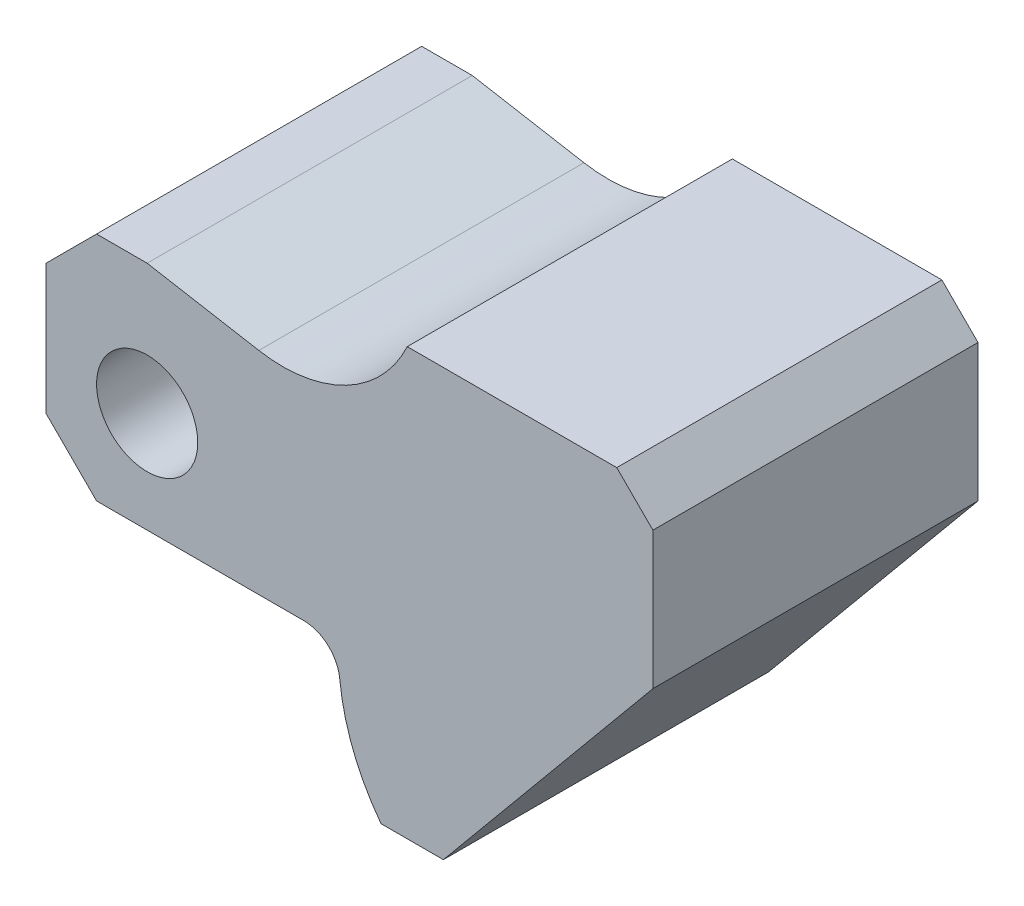
ISO-10303-21;
HEADER;
FILE_DESCRIPTION(('STEP AP214'),'2;1');
FILE_NAME('part.step','',(''),(''),'','','');
FILE_SCHEMA(('AUTOMOTIVE_DESIGN { 1 0 10303 214 1 1 1 1 }'));
ENDSEC;
DATA;
#1=APPLICATION_CONTEXT('core data for automotive mechanical design processes');
#2=APPLICATION_PROTOCOL_DEFINITION('international standard','automotive_design',2000,#1);
#3=PRODUCT_CONTEXT('',#1,'mechanical');
#4=PRODUCT('Part','Part','',(#3));
#5=PRODUCT_RELATED_PRODUCT_CATEGORY('part','',(#4));
#6=PRODUCT_DEFINITION_FORMATION('','',#4);
#7=PRODUCT_DEFINITION_CONTEXT('part definition',#1,'design');
#8=PRODUCT_DEFINITION('design','',#6,#7);
#9=PRODUCT_DEFINITION_SHAPE('','',#8);
#10=(LENGTH_UNIT() NAMED_UNIT(*) SI_UNIT(.MILLI.,.METRE.));
#11=(NAMED_UNIT(*) PLANE_ANGLE_UNIT() SI_UNIT($,.RADIAN.));
#12=(NAMED_UNIT(*) SI_UNIT($,.STERADIAN.) SOLID_ANGLE_UNIT());
#13=UNCERTAINTY_MEASURE_WITH_UNIT(LENGTH_MEASURE(1.E-05),#10,'distance_accuracy_value','');
#14=(GEOMETRIC_REPRESENTATION_CONTEXT(3) GLOBAL_UNCERTAINTY_ASSIGNED_CONTEXT((#13)) GLOBAL_UNIT_ASSIGNED_CONTEXT((#10,
#11,#12)) REPRESENTATION_CONTEXT('',''));
#15=CARTESIAN_POINT('',(0.,0.,0.));
#16=DIRECTION('',(0.,0.,1.));
#17=DIRECTION('',(1.,0.,0.));
#18=AXIS2_PLACEMENT_3D('',#15,#16,#17);
#19=CARTESIAN_POINT('',(18.7594959903131,33.9853003382447,45.));
#20=DIRECTION('',(0.,0.,1.));
#21=DIRECTION('',(1.,0.,0.));
#22=AXIS2_PLACEMENT_3D('',#19,#20,#21);
#23=PLANE('',#22);
#24=DIRECTION('',(-0.707106781186543,-0.707106781186552,0.));
#25=VECTOR('',#24,1.);
#26=CARTESIAN_POINT('',(-14.,11.,45.));
#27=LINE('',#26,#25);
#28=CARTESIAN_POINT('',(-7.00000000000008,18.,45.));
#29=VERTEX_POINT('',#28);
#30=CARTESIAN_POINT('',(-14.,11.,45.));
#31=VERTEX_POINT('',#30);
#32=EDGE_CURVE('E204',#29,#31,#27,.T.);
#33=ORIENTED_EDGE('',*,*,#32,.T.);
#34=DIRECTION('',(0.,-1.,0.));
#35=VECTOR('',#34,1.);
#36=CARTESIAN_POINT('',(-14.,11.,45.));
#37=LINE('',#36,#35);
#38=CARTESIAN_POINT('',(-14.,-7.,45.));
#39=VERTEX_POINT('',#38);
#40=EDGE_CURVE('E122',#31,#39,#37,.T.);
#41=ORIENTED_EDGE('',*,*,#40,.T.);
#42=DIRECTION('',(0.707106781186549,-0.707106781186546,0.));
#43=VECTOR('',#42,1.);
#44=CARTESIAN_POINT('',(-14.,-7.,45.));
#45=LINE('',#44,#43);
#46=CARTESIAN_POINT('',(-6.99999999999997,-14.,45.));
#47=VERTEX_POINT('',#46);
#48=EDGE_CURVE('E237',#39,#47,#45,.T.);
#49=ORIENTED_EDGE('',*,*,#48,.T.);
#50=DIRECTION('',(1.,0.,0.));
#51=VECTOR('',#50,1.);
#52=CARTESIAN_POINT('',(-6.99999999999997,-14.,45.));
#53=LINE('',#52,#51);
#54=CARTESIAN_POINT('',(21.6806268538283,-14.,45.));
#55=VERTEX_POINT('',#54);
#56=EDGE_CURVE('E256',#47,#55,#53,.T.);
#57=ORIENTED_EDGE('',*,*,#56,.T.);
#58=CARTESIAN_POINT('',(21.6806268538283,-19.,45.));
#59=DIRECTION('',(0.,0.,-1.));
#60=DIRECTION('',(-1.,0.,0.));
#61=AXIS2_PLACEMENT_3D('',#58,#59,#60);
#62=CIRCLE('',#61,5.);
#63=CARTESIAN_POINT('',(26.6540640812065,-18.4852941176471,45.));
#64=VERTEX_POINT('',#63);
#65=EDGE_CURVE('E253',#55,#64,#62,.T.);
#66=ORIENTED_EDGE('',*,*,#65,.T.);
#67=CARTESIAN_POINT('',(55.5,-15.5,45.));
#68=DIRECTION('',(0.,0.,1.));
#69=DIRECTION('',(1.,0.,0.));
#70=AXIS2_PLACEMENT_3D('',#67,#68,#69);
#71=CIRCLE('',#70,29.);
#72=CARTESIAN_POINT('',(32.3753378403056,-33.,45.));
#73=VERTEX_POINT('',#72);
#74=EDGE_CURVE('E255',#64,#73,#71,.T.);
#75=ORIENTED_EDGE('',*,*,#74,.T.);
#76=DIRECTION('',(1.,0.,0.));
#77=VECTOR('',#76,1.);
#78=CARTESIAN_POINT('',(41.,-33.,45.));
#79=LINE('',#78,#77);
#80=CARTESIAN_POINT('',(41.,-33.,45.));
#81=VERTEX_POINT('',#80);
#82=EDGE_CURVE('E258',#73,#81,#79,.T.);
#83=ORIENTED_EDGE('',*,*,#82,.T.);
#84=DIRECTION('',(0.638017864750323,0.770021560905562,0.));
#85=VECTOR('',#84,1.);
#86=CARTESIAN_POINT('',(70.,1.99999999999998,45.));
#87=LINE('',#86,#85);
#88=CARTESIAN_POINT('',(70.,1.99999999999998,45.));
#89=VERTEX_POINT('',#88);
#90=EDGE_CURVE('E264',#81,#89,#87,.T.);
#91=ORIENTED_EDGE('',*,*,#90,.T.);
#92=DIRECTION('',(0.,1.,0.));
#93=VECTOR('',#92,1.);
#94=CARTESIAN_POINT('',(70.,21.,45.));
#95=LINE('',#94,#93);
#96=CARTESIAN_POINT('',(70.,21.,45.));
#97=VERTEX_POINT('',#96);
#98=EDGE_CURVE('E266',#89,#97,#95,.T.);
#99=ORIENTED_EDGE('',*,*,#98,.T.);
#100=DIRECTION('',(-0.707106781186552,0.707106781186542,0.));
#101=VECTOR('',#100,1.);
#102=CARTESIAN_POINT('',(64.9999999999999,26.,45.));
#103=LINE('',#102,#101);
#104=CARTESIAN_POINT('',(64.9999999999999,26.,45.));
#105=VERTEX_POINT('',#104);
#106=EDGE_CURVE('E268',#97,#105,#103,.T.);
#107=ORIENTED_EDGE('',*,*,#106,.T.);
#108=DIRECTION('',(-1.,0.,0.));
#109=VECTOR('',#108,1.);
#110=CARTESIAN_POINT('',(36.,26.,45.));
#111=LINE('',#110,#109);
#112=CARTESIAN_POINT('',(36.,26.,45.));
#113=VERTEX_POINT('',#112);
#114=EDGE_CURVE('E159',#105,#113,#111,.T.);
#115=ORIENTED_EDGE('',*,*,#114,.T.);
#116=CARTESIAN_POINT('',(18.7594959903131,33.9853003382447,45.));
#117=DIRECTION('',(0.,0.,-1.));
#118=DIRECTION('',(1.,0.,0.));
#119=AXIS2_PLACEMENT_3D('',#116,#117,#118);
#120=CIRCLE('',#119,19.);
#121=CARTESIAN_POINT('',(15.4601806146414,15.2739530310127,45.));
#122=VERTEX_POINT('',#121);
#123=EDGE_CURVE('E153',#113,#122,#120,.T.);
#124=ORIENTED_EDGE('',*,*,#123,.T.);
#125=DIRECTION('',(-0.984807753012208,0.173648177666931,0.));
#126=VECTOR('',#125,1.);
#127=CARTESIAN_POINT('',(0.,18.,45.));
#128=LINE('',#127,#126);
#129=CARTESIAN_POINT('',(0.,18.,45.));
#130=VERTEX_POINT('',#129);
#131=EDGE_CURVE('E157',#122,#130,#128,.T.);
#132=ORIENTED_EDGE('',*,*,#131,.T.);
#133=DIRECTION('',(-1.,0.,0.));
#134=VECTOR('',#133,1.);
#135=CARTESIAN_POINT('',(-7.00000000000008,18.,45.));
#136=LINE('',#135,#134);
#137=EDGE_CURVE('E61',#130,#29,#136,.T.);
#138=ORIENTED_EDGE('',*,*,#137,.T.);
#139=EDGE_LOOP('',(#33,#41,#49,#57,#66,#75,#83,#91,#99,#107,#115,#124,#132,#138));
#140=FACE_BOUND('',#139,.T.);
#141=CARTESIAN_POINT('',(0.,0.,45.));
#142=DIRECTION('',(0.,0.,1.));
#143=DIRECTION('',(1.,0.,0.));
#144=AXIS2_PLACEMENT_3D('',#141,#142,#143);
#145=CIRCLE('',#144,7.);
#146=CARTESIAN_POINT('',(7.,0.,45.));
#147=VERTEX_POINT('',#146);
#148=EDGE_CURVE('E181',#147,#147,#145,.T.);
#149=ORIENTED_EDGE('',*,*,#148,.F.);
#150=EDGE_LOOP('',(#149));
#151=FACE_BOUND('',#150,.T.);
#152=ADVANCED_FACE('F44',(#140,#151),#23,.T.);
#153=CARTESIAN_POINT('',(18.7594959903131,33.9853003382447,0.));
#154=DIRECTION('',(0.,0.,1.));
#155=DIRECTION('',(1.,0.,0.));
#156=AXIS2_PLACEMENT_3D('',#153,#154,#155);
#157=PLANE('',#156);
#158=DIRECTION('',(-0.707106781186543,-0.707106781186552,0.));
#159=VECTOR('',#158,1.);
#160=CARTESIAN_POINT('',(-14.,11.,0.));
#161=LINE('',#160,#159);
#162=CARTESIAN_POINT('',(-7.00000000000008,18.,0.));
#163=VERTEX_POINT('',#162);
#164=CARTESIAN_POINT('',(-14.,11.,0.));
#165=VERTEX_POINT('',#164);
#166=EDGE_CURVE('E177',#163,#165,#161,.T.);
#167=ORIENTED_EDGE('',*,*,#166,.F.);
#168=DIRECTION('',(-1.,0.,0.));
#169=VECTOR('',#168,1.);
#170=CARTESIAN_POINT('',(-7.00000000000008,18.,0.));
#171=LINE('',#170,#169);
#172=CARTESIAN_POINT('',(0.,18.,0.));
#173=VERTEX_POINT('',#172);
#174=EDGE_CURVE('E114',#173,#163,#171,.T.);
#175=ORIENTED_EDGE('',*,*,#174,.F.);
#176=DIRECTION('',(-0.984807753012208,0.173648177666931,0.));
#177=VECTOR('',#176,1.);
#178=CARTESIAN_POINT('',(0.,18.,0.));
#179=LINE('',#178,#177);
#180=CARTESIAN_POINT('',(15.4601806146414,15.2739530310127,0.));
#181=VERTEX_POINT('',#180);
#182=EDGE_CURVE('E108',#181,#173,#179,.T.);
#183=ORIENTED_EDGE('',*,*,#182,.F.);
#184=CARTESIAN_POINT('',(18.7594959903131,33.9853003382447,0.));
#185=DIRECTION('',(0.,0.,-1.));
#186=DIRECTION('',(1.,0.,0.));
#187=AXIS2_PLACEMENT_3D('',#184,#185,#186);
#188=CIRCLE('',#187,19.);
#189=CARTESIAN_POINT('',(36.,26.,0.));
#190=VERTEX_POINT('',#189);
#191=EDGE_CURVE('E167',#190,#181,#188,.T.);
#192=ORIENTED_EDGE('',*,*,#191,.F.);
#193=DIRECTION('',(-1.,0.,0.));
#194=VECTOR('',#193,1.);
#195=CARTESIAN_POINT('',(36.,26.,0.));
#196=LINE('',#195,#194);
#197=CARTESIAN_POINT('',(64.9999999999999,26.,0.));
#198=VERTEX_POINT('',#197);
#199=EDGE_CURVE('E199',#198,#190,#196,.T.);
#200=ORIENTED_EDGE('',*,*,#199,.F.);
#201=DIRECTION('',(-0.707106781186552,0.707106781186542,0.));
#202=VECTOR('',#201,1.);
#203=CARTESIAN_POINT('',(64.9999999999999,26.,0.));
#204=LINE('',#203,#202);
#205=CARTESIAN_POINT('',(70.,21.,0.));
#206=VERTEX_POINT('',#205);
#207=EDGE_CURVE('E197',#206,#198,#204,.T.);
#208=ORIENTED_EDGE('',*,*,#207,.F.);
#209=DIRECTION('',(0.,1.,0.));
#210=VECTOR('',#209,1.);
#211=CARTESIAN_POINT('',(70.,21.,0.));
#212=LINE('',#211,#210);
#213=CARTESIAN_POINT('',(70.,1.99999999999998,0.));
#214=VERTEX_POINT('',#213);
#215=EDGE_CURVE('E195',#214,#206,#212,.T.);
#216=ORIENTED_EDGE('',*,*,#215,.F.);
#217=DIRECTION('',(0.638017864750323,0.770021560905562,0.));
#218=VECTOR('',#217,1.);
#219=CARTESIAN_POINT('',(70.,1.99999999999998,0.));
#220=LINE('',#219,#218);
#221=CARTESIAN_POINT('',(41.,-33.,0.));
#222=VERTEX_POINT('',#221);
#223=EDGE_CURVE('E193',#222,#214,#220,.T.);
#224=ORIENTED_EDGE('',*,*,#223,.F.);
#225=DIRECTION('',(1.,0.,0.));
#226=VECTOR('',#225,1.);
#227=CARTESIAN_POINT('',(41.,-33.,0.));
#228=LINE('',#227,#226);
#229=CARTESIAN_POINT('',(32.3753378403056,-33.,0.));
#230=VERTEX_POINT('',#229);
#231=EDGE_CURVE('E191',#230,#222,#228,.T.);
#232=ORIENTED_EDGE('',*,*,#231,.F.);
#233=CARTESIAN_POINT('',(55.5,-15.5,0.));
#234=DIRECTION('',(0.,0.,1.));
#235=DIRECTION('',(1.,0.,0.));
#236=AXIS2_PLACEMENT_3D('',#233,#234,#235);
#237=CIRCLE('',#236,29.);
#238=CARTESIAN_POINT('',(26.6540640812065,-18.4852941176471,0.));
#239=VERTEX_POINT('',#238);
#240=EDGE_CURVE('E189',#239,#230,#237,.T.);
#241=ORIENTED_EDGE('',*,*,#240,.F.);
#242=CARTESIAN_POINT('',(21.6806268538283,-19.,0.));
#243=DIRECTION('',(0.,0.,-1.));
#244=DIRECTION('',(-1.,0.,0.));
#245=AXIS2_PLACEMENT_3D('',#242,#243,#244);
#246=CIRCLE('',#245,5.);
#247=CARTESIAN_POINT('',(21.6806268538283,-14.,0.));
#248=VERTEX_POINT('',#247);
#249=EDGE_CURVE('E187',#248,#239,#246,.T.);
#250=ORIENTED_EDGE('',*,*,#249,.F.);
#251=DIRECTION('',(1.,0.,0.));
#252=VECTOR('',#251,1.);
#253=CARTESIAN_POINT('',(-6.99999999999997,-14.,0.));
#254=LINE('',#253,#252);
#255=CARTESIAN_POINT('',(-6.99999999999997,-14.,0.));
#256=VERTEX_POINT('',#255);
#257=EDGE_CURVE('E185',#256,#248,#254,.T.);
#258=ORIENTED_EDGE('',*,*,#257,.F.);
#259=DIRECTION('',(0.707106781186549,-0.707106781186546,0.));
#260=VECTOR('',#259,1.);
#261=CARTESIAN_POINT('',(-14.,-7.,0.));
#262=LINE('',#261,#260);
#263=CARTESIAN_POINT('',(-14.,-7.,0.));
#264=VERTEX_POINT('',#263);
#265=EDGE_CURVE('E183',#264,#256,#262,.T.);
#266=ORIENTED_EDGE('',*,*,#265,.F.);
#267=DIRECTION('',(0.,-1.,0.));
#268=VECTOR('',#267,1.);
#269=CARTESIAN_POINT('',(-14.,11.,0.));
#270=LINE('',#269,#268);
#271=EDGE_CURVE('E180',#165,#264,#270,.T.);
#272=ORIENTED_EDGE('',*,*,#271,.F.);
#273=EDGE_LOOP('',(#167,#175,#183,#192,#200,#208,#216,#224,#232,#241,#250,#258,#266,#272));
#274=FACE_BOUND('',#273,.T.);
#275=CARTESIAN_POINT('',(0.,0.,0.));
#276=DIRECTION('',(0.,0.,1.));
#277=DIRECTION('',(1.,0.,0.));
#278=AXIS2_PLACEMENT_3D('',#275,#276,#277);
#279=CIRCLE('',#278,7.);
#280=CARTESIAN_POINT('',(7.,0.,0.));
#281=VERTEX_POINT('',#280);
#282=EDGE_CURVE('E509',#281,#281,#279,.T.);
#283=ORIENTED_EDGE('',*,*,#282,.T.);
#284=EDGE_LOOP('',(#283));
#285=FACE_BOUND('',#284,.T.);
#286=ADVANCED_FACE('F241',(#274,#285),#157,.F.);
#287=CARTESIAN_POINT('',(-14.,11.,45.));
#288=DIRECTION('',(0.707106781186551,-0.707106781186543,0.));
#289=DIRECTION('',(0.707106781186544,0.707106781186552,0.));
#290=AXIS2_PLACEMENT_3D('',#287,#288,#289);
#291=PLANE('',#290);
#292=ORIENTED_EDGE('',*,*,#166,.T.);
#293=DIRECTION('',(0.,0.,-1.));
#294=VECTOR('',#293,1.);
#295=CARTESIAN_POINT('',(-14.,11.,45.));
#296=LINE('',#295,#294);
#297=EDGE_CURVE('E11',#31,#165,#296,.T.);
#298=ORIENTED_EDGE('',*,*,#297,.F.);
#299=ORIENTED_EDGE('',*,*,#32,.F.);
#300=DIRECTION('',(0.,0.,-1.));
#301=VECTOR('',#300,1.);
#302=CARTESIAN_POINT('',(-7.00000000000008,18.,45.));
#303=LINE('',#302,#301);
#304=EDGE_CURVE('E173',#29,#163,#303,.T.);
#305=ORIENTED_EDGE('',*,*,#304,.T.);
#306=EDGE_LOOP('',(#292,#298,#299,#305));
#307=FACE_BOUND('',#306,.T.);
#308=ADVANCED_FACE('F46',(#307),#291,.F.);
#309=CARTESIAN_POINT('',(-14.,11.,45.));
#310=DIRECTION('',(1.,0.,0.));
#311=DIRECTION('',(0.,0.,-1.));
#312=AXIS2_PLACEMENT_3D('',#309,#310,#311);
#313=PLANE('',#312);
#314=ORIENTED_EDGE('',*,*,#271,.T.);
#315=DIRECTION('',(0.,0.,-1.));
#316=VECTOR('',#315,1.);
#317=CARTESIAN_POINT('',(-14.,-7.,45.));
#318=LINE('',#317,#316);
#319=EDGE_CURVE('E53',#39,#264,#318,.T.);
#320=ORIENTED_EDGE('',*,*,#319,.F.);
#321=ORIENTED_EDGE('',*,*,#40,.F.);
#322=ORIENTED_EDGE('',*,*,#297,.T.);
#323=EDGE_LOOP('',(#314,#320,#321,#322));
#324=FACE_BOUND('',#323,.T.);
#325=ADVANCED_FACE('F302',(#324),#313,.F.);
#326=CARTESIAN_POINT('',(-14.,-7.,45.));
#327=DIRECTION('',(0.707106781186546,0.707106781186549,0.));
#328=DIRECTION('',(-0.707106781186549,0.707106781186546,0.));
#329=AXIS2_PLACEMENT_3D('',#326,#327,#328);
#330=PLANE('',#329);
#331=ORIENTED_EDGE('',*,*,#265,.T.);
#332=DIRECTION('',(0.,0.,-1.));
#333=VECTOR('',#332,1.);
#334=CARTESIAN_POINT('',(-6.99999999999997,-14.,45.));
#335=LINE('',#334,#333);
#336=EDGE_CURVE('E229',#47,#256,#335,.T.);
#337=ORIENTED_EDGE('',*,*,#336,.F.);
#338=ORIENTED_EDGE('',*,*,#48,.F.);
#339=ORIENTED_EDGE('',*,*,#319,.T.);
#340=EDGE_LOOP('',(#331,#337,#338,#339));
#341=FACE_BOUND('',#340,.T.);
#342=ADVANCED_FACE('F235',(#341),#330,.F.);
#343=CARTESIAN_POINT('',(-6.99999999999997,-14.,45.));
#344=DIRECTION('',(0.,1.,0.));
#345=DIRECTION('',(-1.,0.,0.));
#346=AXIS2_PLACEMENT_3D('',#343,#344,#345);
#347=PLANE('',#346);
#348=ORIENTED_EDGE('',*,*,#257,.T.);
#349=DIRECTION('',(0.,0.,-1.));
#350=VECTOR('',#349,1.);
#351=CARTESIAN_POINT('',(21.6806268538283,-14.,45.));
#352=LINE('',#351,#350);
#353=EDGE_CURVE('E226',#55,#248,#352,.T.);
#354=ORIENTED_EDGE('',*,*,#353,.F.);
#355=ORIENTED_EDGE('',*,*,#56,.F.);
#356=ORIENTED_EDGE('',*,*,#336,.T.);
#357=EDGE_LOOP('',(#348,#354,#355,#356));
#358=FACE_BOUND('',#357,.T.);
#359=ADVANCED_FACE('F247',(#358),#347,.F.);
#360=CARTESIAN_POINT('',(21.6806268538283,-19.,45.));
#361=DIRECTION('',(0.,0.,-1.));
#362=DIRECTION('',(-1.,0.,0.));
#363=AXIS2_PLACEMENT_3D('',#360,#361,#362);
#364=CYLINDRICAL_SURFACE('',#363,5.);
#365=ORIENTED_EDGE('',*,*,#249,.T.);
#366=DIRECTION('',(0.,0.,-1.));
#367=VECTOR('',#366,1.);
#368=CARTESIAN_POINT('',(26.6540640812065,-18.4852941176471,45.));
#369=LINE('',#368,#367);
#370=EDGE_CURVE('E223',#64,#239,#369,.T.);
#371=ORIENTED_EDGE('',*,*,#370,.F.);
#372=ORIENTED_EDGE('',*,*,#65,.F.);
#373=ORIENTED_EDGE('',*,*,#353,.T.);
#374=EDGE_LOOP('',(#365,#371,#372,#373));
#375=FACE_BOUND('',#374,.T.);
#376=ADVANCED_FACE('F251',(#375),#364,.F.);
#377=CARTESIAN_POINT('',(55.5,-15.5,45.));
#378=DIRECTION('',(0.,0.,-1.));
#379=DIRECTION('',(-1.,0.,0.));
#380=AXIS2_PLACEMENT_3D('',#377,#378,#379);
#381=CYLINDRICAL_SURFACE('',#380,29.);
#382=ORIENTED_EDGE('',*,*,#240,.T.);
#383=DIRECTION('',(0.,0.,-1.));
#384=VECTOR('',#383,1.);
#385=CARTESIAN_POINT('',(32.3753378403056,-33.,45.));
#386=LINE('',#385,#384);
#387=EDGE_CURVE('E220',#73,#230,#386,.T.);
#388=ORIENTED_EDGE('',*,*,#387,.F.);
#389=ORIENTED_EDGE('',*,*,#74,.F.);
#390=ORIENTED_EDGE('',*,*,#370,.T.);
#391=EDGE_LOOP('',(#382,#388,#389,#390));
#392=FACE_BOUND('',#391,.T.);
#393=ADVANCED_FACE('F315',(#392),#381,.T.);
#394=CARTESIAN_POINT('',(41.,-33.,45.));
#395=DIRECTION('',(0.,1.,0.));
#396=DIRECTION('',(-1.,0.,0.));
#397=AXIS2_PLACEMENT_3D('',#394,#395,#396);
#398=PLANE('',#397);
#399=ORIENTED_EDGE('',*,*,#231,.T.);
#400=DIRECTION('',(0.,0.,-1.));
#401=VECTOR('',#400,1.);
#402=CARTESIAN_POINT('',(41.,-33.,45.));
#403=LINE('',#402,#401);
#404=EDGE_CURVE('E217',#81,#222,#403,.T.);
#405=ORIENTED_EDGE('',*,*,#404,.F.);
#406=ORIENTED_EDGE('',*,*,#82,.F.);
#407=ORIENTED_EDGE('',*,*,#387,.T.);
#408=EDGE_LOOP('',(#399,#405,#406,#407));
#409=FACE_BOUND('',#408,.T.);
#410=ADVANCED_FACE('F318',(#409),#398,.F.);
#411=CARTESIAN_POINT('',(70.,1.99999999999998,45.));
#412=DIRECTION('',(-0.770021560905562,0.638017864750323,0.));
#413=DIRECTION('',(-0.638017864750323,-0.770021560905562,0.));
#414=AXIS2_PLACEMENT_3D('',#411,#412,#413);
#415=PLANE('',#414);
#416=ORIENTED_EDGE('',*,*,#223,.T.);
#417=DIRECTION('',(0.,0.,-1.));
#418=VECTOR('',#417,1.);
#419=CARTESIAN_POINT('',(70.,1.99999999999998,45.));
#420=LINE('',#419,#418);
#421=EDGE_CURVE('E214',#89,#214,#420,.T.);
#422=ORIENTED_EDGE('',*,*,#421,.F.);
#423=ORIENTED_EDGE('',*,*,#90,.F.);
#424=ORIENTED_EDGE('',*,*,#404,.T.);
#425=EDGE_LOOP('',(#416,#422,#423,#424));
#426=FACE_BOUND('',#425,.T.);
#427=ADVANCED_FACE('F322',(#426),#415,.F.);
#428=CARTESIAN_POINT('',(70.,21.,45.));
#429=DIRECTION('',(-1.,0.,0.));
#430=DIRECTION('',(0.,0.,1.));
#431=AXIS2_PLACEMENT_3D('',#428,#429,#430);
#432=PLANE('',#431);
#433=ORIENTED_EDGE('',*,*,#215,.T.);
#434=DIRECTION('',(0.,0.,-1.));
#435=VECTOR('',#434,1.);
#436=CARTESIAN_POINT('',(70.,21.,45.));
#437=LINE('',#436,#435);
#438=EDGE_CURVE('E211',#97,#206,#437,.T.);
#439=ORIENTED_EDGE('',*,*,#438,.F.);
#440=ORIENTED_EDGE('',*,*,#98,.F.);
#441=ORIENTED_EDGE('',*,*,#421,.T.);
#442=EDGE_LOOP('',(#433,#439,#440,#441));
#443=FACE_BOUND('',#442,.T.);
#444=ADVANCED_FACE('F326',(#443),#432,.F.);
#445=CARTESIAN_POINT('',(64.9999999999999,26.,45.));
#446=DIRECTION('',(-0.707106781186542,-0.707106781186552,0.));
#447=DIRECTION('',(0.707106781186552,-0.707106781186543,0.));
#448=AXIS2_PLACEMENT_3D('',#445,#446,#447);
#449=PLANE('',#448);
#450=ORIENTED_EDGE('',*,*,#207,.T.);
#451=DIRECTION('',(0.,0.,-1.));
#452=VECTOR('',#451,1.);
#453=CARTESIAN_POINT('',(64.9999999999999,26.,45.));
#454=LINE('',#453,#452);
#455=EDGE_CURVE('E208',#105,#198,#454,.T.);
#456=ORIENTED_EDGE('',*,*,#455,.F.);
#457=ORIENTED_EDGE('',*,*,#106,.F.);
#458=ORIENTED_EDGE('',*,*,#438,.T.);
#459=EDGE_LOOP('',(#450,#456,#457,#458));
#460=FACE_BOUND('',#459,.T.);
#461=ADVANCED_FACE('F274',(#460),#449,.F.);
#462=CARTESIAN_POINT('',(36.,26.,45.));
#463=DIRECTION('',(0.,-1.,0.));
#464=DIRECTION('',(0.,0.,-1.));
#465=AXIS2_PLACEMENT_3D('',#462,#463,#464);
#466=PLANE('',#465);
#467=ORIENTED_EDGE('',*,*,#199,.T.);
#468=DIRECTION('',(0.,0.,-1.));
#469=VECTOR('',#468,1.);
#470=CARTESIAN_POINT('',(36.,26.,45.));
#471=LINE('',#470,#469);
#472=EDGE_CURVE('E168',#113,#190,#471,.T.);
#473=ORIENTED_EDGE('',*,*,#472,.F.);
#474=ORIENTED_EDGE('',*,*,#114,.F.);
#475=ORIENTED_EDGE('',*,*,#455,.T.);
#476=EDGE_LOOP('',(#467,#473,#474,#475));
#477=FACE_BOUND('',#476,.T.);
#478=ADVANCED_FACE('F278',(#477),#466,.F.);
#479=CARTESIAN_POINT('',(18.7594959903131,33.9853003382447,45.));
#480=DIRECTION('',(0.,0.,-1.));
#481=DIRECTION('',(-1.,0.,0.));
#482=AXIS2_PLACEMENT_3D('',#479,#480,#481);
#483=CYLINDRICAL_SURFACE('',#482,19.);
#484=ORIENTED_EDGE('',*,*,#191,.T.);
#485=DIRECTION('',(0.,0.,-1.));
#486=VECTOR('',#485,1.);
#487=CARTESIAN_POINT('',(15.4601806146414,15.2739530310127,45.));
#488=LINE('',#487,#486);
#489=EDGE_CURVE('E164',#122,#181,#488,.T.);
#490=ORIENTED_EDGE('',*,*,#489,.F.);
#491=ORIENTED_EDGE('',*,*,#123,.F.);
#492=ORIENTED_EDGE('',*,*,#472,.T.);
#493=EDGE_LOOP('',(#484,#490,#491,#492));
#494=FACE_BOUND('',#493,.T.);
#495=ADVANCED_FACE('F165',(#494),#483,.F.);
#496=CARTESIAN_POINT('',(0.,18.,45.));
#497=DIRECTION('',(-0.173648177666931,-0.984807753012208,0.));
#498=DIRECTION('',(0.984807753012208,-0.173648177666931,0.));
#499=AXIS2_PLACEMENT_3D('',#496,#497,#498);
#500=PLANE('',#499);
#501=ORIENTED_EDGE('',*,*,#182,.T.);
#502=DIRECTION('',(0.,0.,-1.));
#503=VECTOR('',#502,1.);
#504=CARTESIAN_POINT('',(0.,18.,45.));
#505=LINE('',#504,#503);
#506=EDGE_CURVE('E169',#130,#173,#505,.T.);
#507=ORIENTED_EDGE('',*,*,#506,.F.);
#508=ORIENTED_EDGE('',*,*,#131,.F.);
#509=ORIENTED_EDGE('',*,*,#489,.T.);
#510=EDGE_LOOP('',(#501,#507,#508,#509));
#511=FACE_BOUND('',#510,.T.);
#512=ADVANCED_FACE('F171',(#511),#500,.F.);
#513=CARTESIAN_POINT('',(-7.00000000000008,18.,45.));
#514=DIRECTION('',(0.,-1.,0.));
#515=DIRECTION('',(0.,0.,-1.));
#516=AXIS2_PLACEMENT_3D('',#513,#514,#515);
#517=PLANE('',#516);
#518=ORIENTED_EDGE('',*,*,#174,.T.);
#519=ORIENTED_EDGE('',*,*,#304,.F.);
#520=ORIENTED_EDGE('',*,*,#137,.F.);
#521=ORIENTED_EDGE('',*,*,#506,.T.);
#522=EDGE_LOOP('',(#518,#519,#520,#521));
#523=FACE_BOUND('',#522,.T.);
#524=ADVANCED_FACE('F282',(#523),#517,.F.);
#525=CARTESIAN_POINT('',(0.,0.,45.));
#526=DIRECTION('',(0.,0.,-1.));
#527=DIRECTION('',(-1.,0.,0.));
#528=AXIS2_PLACEMENT_3D('',#525,#526,#527);
#529=CYLINDRICAL_SURFACE('',#528,7.);
#530=ORIENTED_EDGE('',*,*,#148,.T.);
#531=EDGE_LOOP('',(#530));
#532=FACE_BOUND('',#531,.T.);
#533=ORIENTED_EDGE('',*,*,#282,.F.);
#534=EDGE_LOOP('',(#533));
#535=FACE_BOUND('',#534,.T.);
#536=ADVANCED_FACE('F284',(#532,#535),#529,.F.);
#537=CLOSED_SHELL('',(#152,#286,#308,#325,#342,#359,#376,#393,#410,#427,#444,#461,#478,#495,
#512,#524,#536));
#538=MANIFOLD_SOLID_BREP('B2',#537);
#539=ADVANCED_BREP_SHAPE_REPRESENTATION('',(#18,#538),#14);
#540=SHAPE_DEFINITION_REPRESENTATION(#9,#539);
ENDSEC;
END-ISO-10303-21;
